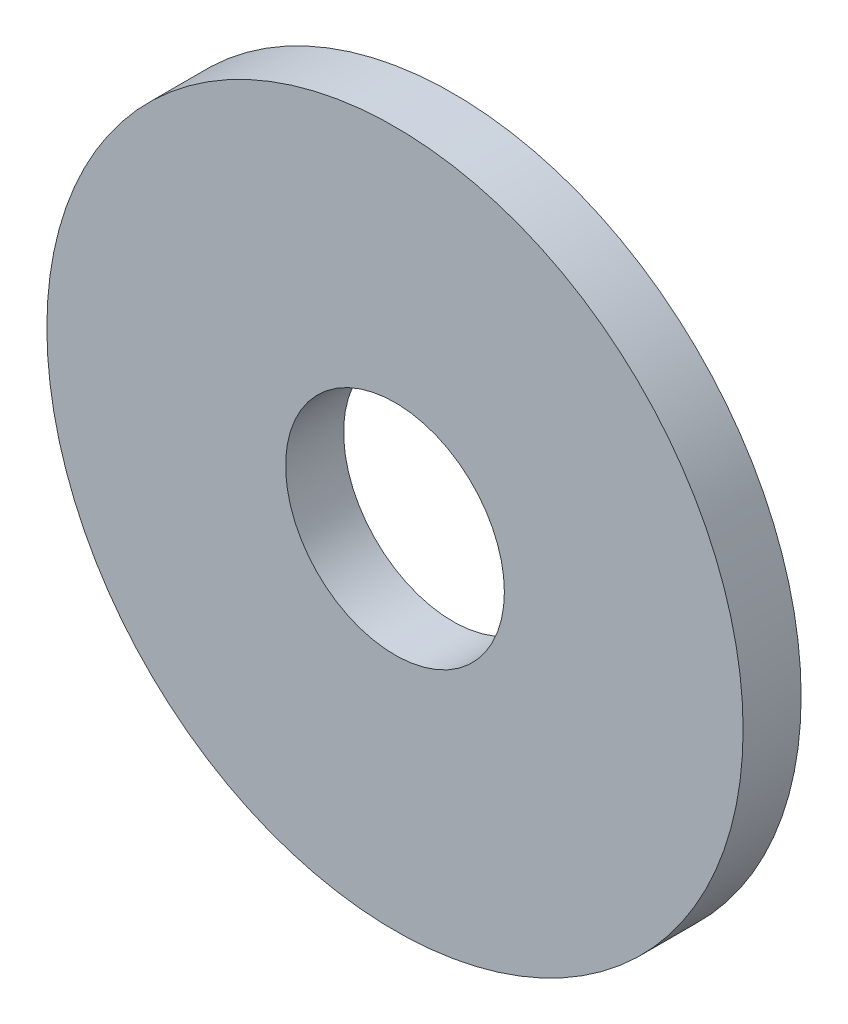
ISO-10303-21;
HEADER;
FILE_DESCRIPTION(('STEP AP214'),'2;1');
FILE_NAME('part.step','',(''),(''),'','','');
FILE_SCHEMA(('AUTOMOTIVE_DESIGN { 1 0 10303 214 1 1 1 1 }'));
ENDSEC;
DATA;
#1=APPLICATION_CONTEXT('core data for automotive mechanical design processes');
#2=APPLICATION_PROTOCOL_DEFINITION('international standard','automotive_design',2000,#1);
#3=PRODUCT_CONTEXT('',#1,'mechanical');
#4=PRODUCT('Part','Part','',(#3));
#5=PRODUCT_RELATED_PRODUCT_CATEGORY('part','',(#4));
#6=PRODUCT_DEFINITION_FORMATION('','',#4);
#7=PRODUCT_DEFINITION_CONTEXT('part definition',#1,'design');
#8=PRODUCT_DEFINITION('design','',#6,#7);
#9=PRODUCT_DEFINITION_SHAPE('','',#8);
#10=(LENGTH_UNIT() NAMED_UNIT(*) SI_UNIT(.MILLI.,.METRE.));
#11=(NAMED_UNIT(*) PLANE_ANGLE_UNIT() SI_UNIT($,.RADIAN.));
#12=(NAMED_UNIT(*) SI_UNIT($,.STERADIAN.) SOLID_ANGLE_UNIT());
#13=UNCERTAINTY_MEASURE_WITH_UNIT(LENGTH_MEASURE(1.E-05),#10,'distance_accuracy_value','');
#14=(GEOMETRIC_REPRESENTATION_CONTEXT(3) GLOBAL_UNCERTAINTY_ASSIGNED_CONTEXT((#13)) GLOBAL_UNIT_ASSIGNED_CONTEXT((#10,
#11,#12)) REPRESENTATION_CONTEXT('',''));
#15=CARTESIAN_POINT('',(0.,0.,0.));
#16=DIRECTION('',(0.,0.,1.));
#17=DIRECTION('',(1.,0.,0.));
#18=AXIS2_PLACEMENT_3D('',#15,#16,#17);
#19=CARTESIAN_POINT('',(0.,0.,1.5875));
#20=DIRECTION('',(0.,0.,1.));
#21=DIRECTION('',(1.,0.,0.));
#22=AXIS2_PLACEMENT_3D('',#19,#20,#21);
#23=PLANE('',#22);
#24=CARTESIAN_POINT('',(0.,0.,1.5875));
#25=DIRECTION('',(0.,0.,1.));
#26=DIRECTION('',(1.,0.,0.));
#27=AXIS2_PLACEMENT_3D('',#24,#25,#26);
#28=CIRCLE('',#27,9.525);
#29=CARTESIAN_POINT('',(9.525,0.,1.5875));
#30=VERTEX_POINT('',#29);
#31=EDGE_CURVE('E10',#30,#30,#28,.T.);
#32=ORIENTED_EDGE('',*,*,#31,.T.);
#33=EDGE_LOOP('',(#32));
#34=FACE_BOUND('',#33,.T.);
#35=CARTESIAN_POINT('',(0.,0.,1.5875));
#36=DIRECTION('',(0.,0.,1.));
#37=DIRECTION('',(1.,0.,0.));
#38=AXIS2_PLACEMENT_3D('',#35,#36,#37);
#39=CIRCLE('',#38,2.99299376);
#40=CARTESIAN_POINT('',(2.99299376,0.,1.5875));
#41=VERTEX_POINT('',#40);
#42=EDGE_CURVE('E41',#41,#41,#39,.T.);
#43=ORIENTED_EDGE('',*,*,#42,.F.);
#44=EDGE_LOOP('',(#43));
#45=FACE_BOUND('',#44,.T.);
#46=ADVANCED_FACE('F30',(#34,#45),#23,.T.);
#47=CARTESIAN_POINT('',(0.,0.,0.));
#48=DIRECTION('',(0.,0.,1.));
#49=DIRECTION('',(1.,0.,0.));
#50=AXIS2_PLACEMENT_3D('',#47,#48,#49);
#51=PLANE('',#50);
#52=CARTESIAN_POINT('',(0.,0.,0.));
#53=DIRECTION('',(0.,0.,1.));
#54=DIRECTION('',(1.,0.,0.));
#55=AXIS2_PLACEMENT_3D('',#52,#53,#54);
#56=CIRCLE('',#55,9.525);
#57=CARTESIAN_POINT('',(9.525,0.,0.));
#58=VERTEX_POINT('',#57);
#59=EDGE_CURVE('E34',#58,#58,#56,.T.);
#60=ORIENTED_EDGE('',*,*,#59,.F.);
#61=EDGE_LOOP('',(#60));
#62=FACE_BOUND('',#61,.T.);
#63=CARTESIAN_POINT('',(0.,0.,0.));
#64=DIRECTION('',(0.,0.,1.));
#65=DIRECTION('',(1.,0.,0.));
#66=AXIS2_PLACEMENT_3D('',#63,#64,#65);
#67=CIRCLE('',#66,2.99299376);
#68=CARTESIAN_POINT('',(2.99299376,0.,0.));
#69=VERTEX_POINT('',#68);
#70=EDGE_CURVE('E43',#69,#69,#67,.T.);
#71=ORIENTED_EDGE('',*,*,#70,.T.);
#72=EDGE_LOOP('',(#71));
#73=FACE_BOUND('',#72,.T.);
#74=ADVANCED_FACE('F53',(#62,#73),#51,.F.);
#75=CARTESIAN_POINT('',(0.,0.,1.5875));
#76=DIRECTION('',(0.,0.,-1.));
#77=DIRECTION('',(-1.,0.,0.));
#78=AXIS2_PLACEMENT_3D('',#75,#76,#77);
#79=CYLINDRICAL_SURFACE('',#78,9.525);
#80=ORIENTED_EDGE('',*,*,#31,.F.);
#81=EDGE_LOOP('',(#80));
#82=FACE_BOUND('',#81,.T.);
#83=ORIENTED_EDGE('',*,*,#59,.T.);
#84=EDGE_LOOP('',(#83));
#85=FACE_BOUND('',#84,.T.);
#86=ADVANCED_FACE('F32',(#82,#85),#79,.T.);
#87=CARTESIAN_POINT('',(0.,0.,1.5875));
#88=DIRECTION('',(0.,0.,-1.));
#89=DIRECTION('',(-1.,0.,0.));
#90=AXIS2_PLACEMENT_3D('',#87,#88,#89);
#91=CYLINDRICAL_SURFACE('',#90,2.99299376);
#92=ORIENTED_EDGE('',*,*,#42,.T.);
#93=EDGE_LOOP('',(#92));
#94=FACE_BOUND('',#93,.T.);
#95=ORIENTED_EDGE('',*,*,#70,.F.);
#96=EDGE_LOOP('',(#95));
#97=FACE_BOUND('',#96,.T.);
#98=ADVANCED_FACE('F49',(#94,#97),#91,.F.);
#99=CLOSED_SHELL('',(#46,#74,#86,#98));
#100=MANIFOLD_SOLID_BREP('B2',#99);
#101=ADVANCED_BREP_SHAPE_REPRESENTATION('',(#18,#100),#14);
#102=SHAPE_DEFINITION_REPRESENTATION(#9,#101);
ENDSEC;
END-ISO-10303-21;
